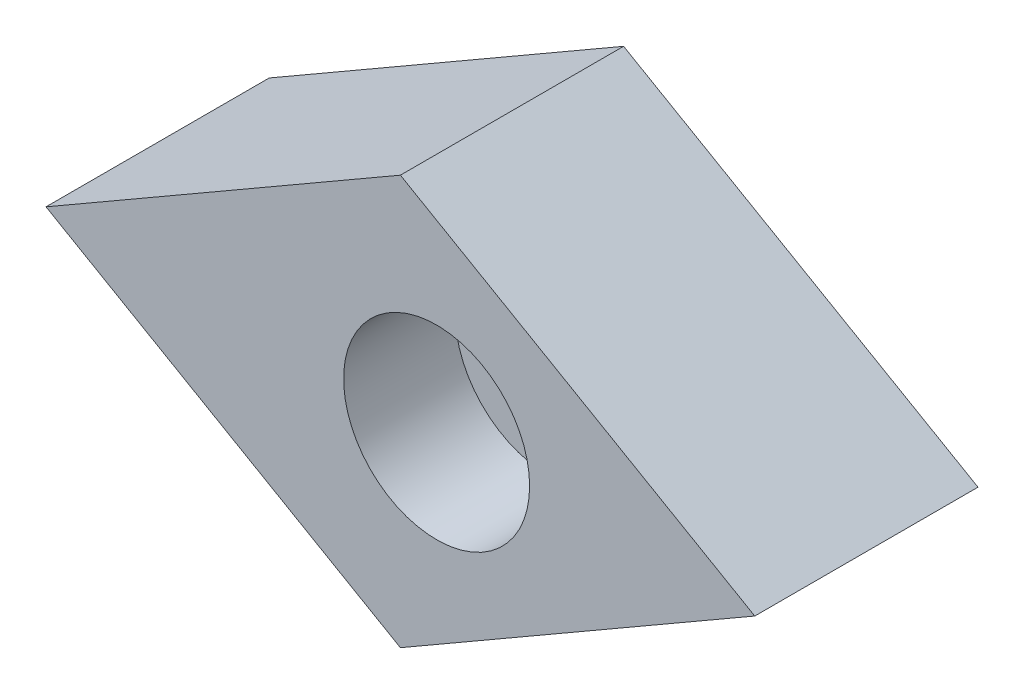
ISO-10303-21;
HEADER;
FILE_DESCRIPTION(('STEP AP214'),'2;1');
FILE_NAME('part.step','',(''),(''),'','','');
FILE_SCHEMA(('AUTOMOTIVE_DESIGN { 1 0 10303 214 1 1 1 1 }'));
ENDSEC;
DATA;
#1=APPLICATION_CONTEXT('core data for automotive mechanical design processes');
#2=APPLICATION_PROTOCOL_DEFINITION('international standard','automotive_design',2000,#1);
#3=PRODUCT_CONTEXT('',#1,'mechanical');
#4=PRODUCT('Part','Part','',(#3));
#5=PRODUCT_RELATED_PRODUCT_CATEGORY('part','',(#4));
#6=PRODUCT_DEFINITION_FORMATION('','',#4);
#7=PRODUCT_DEFINITION_CONTEXT('part definition',#1,'design');
#8=PRODUCT_DEFINITION('design','',#6,#7);
#9=PRODUCT_DEFINITION_SHAPE('','',#8);
#10=(LENGTH_UNIT() NAMED_UNIT(*) SI_UNIT(.MILLI.,.METRE.));
#11=(NAMED_UNIT(*) PLANE_ANGLE_UNIT() SI_UNIT($,.RADIAN.));
#12=(NAMED_UNIT(*) SI_UNIT($,.STERADIAN.) SOLID_ANGLE_UNIT());
#13=UNCERTAINTY_MEASURE_WITH_UNIT(LENGTH_MEASURE(1.E-05),#10,'distance_accuracy_value','');
#14=(GEOMETRIC_REPRESENTATION_CONTEXT(3) GLOBAL_UNCERTAINTY_ASSIGNED_CONTEXT((#13)) GLOBAL_UNIT_ASSIGNED_CONTEXT((#10,
#11,#12)) REPRESENTATION_CONTEXT('',''));
#15=CARTESIAN_POINT('',(0.,0.,0.));
#16=DIRECTION('',(0.,0.,1.));
#17=DIRECTION('',(1.,0.,0.));
#18=AXIS2_PLACEMENT_3D('',#15,#16,#17);
#19=CARTESIAN_POINT('',(9.5262794416289,0.,6.));
#20=DIRECTION('',(-0.499999999999988,-0.866025403784445,0.));
#21=DIRECTION('',(0.866025403784446,-0.499999999999988,0.));
#22=AXIS2_PLACEMENT_3D('',#19,#20,#21);
#23=PLANE('',#22);
#24=DIRECTION('',(-0.866025403784446,0.499999999999988,0.));
#25=VECTOR('',#24,1.);
#26=CARTESIAN_POINT('',(9.5262794416289,0.,0.));
#27=LINE('',#26,#25);
#28=CARTESIAN_POINT('',(9.5262794416289,0.,0.));
#29=VERTEX_POINT('',#28);
#30=CARTESIAN_POINT('',(0.,5.49999999999987,0.));
#31=VERTEX_POINT('',#30);
#32=EDGE_CURVE('E99',#29,#31,#27,.T.);
#33=ORIENTED_EDGE('',*,*,#32,.T.);
#34=DIRECTION('',(0.,0.,-1.));
#35=VECTOR('',#34,1.);
#36=CARTESIAN_POINT('',(0.,5.49999999999987,6.));
#37=LINE('',#36,#35);
#38=CARTESIAN_POINT('',(0.,5.49999999999987,6.));
#39=VERTEX_POINT('',#38);
#40=EDGE_CURVE('E11',#39,#31,#37,.T.);
#41=ORIENTED_EDGE('',*,*,#40,.F.);
#42=DIRECTION('',(-0.866025403784446,0.499999999999988,0.));
#43=VECTOR('',#42,1.);
#44=CARTESIAN_POINT('',(9.5262794416289,0.,6.));
#45=LINE('',#44,#43);
#46=CARTESIAN_POINT('',(9.5262794416289,0.,6.));
#47=VERTEX_POINT('',#46);
#48=EDGE_CURVE('E87',#47,#39,#45,.T.);
#49=ORIENTED_EDGE('',*,*,#48,.F.);
#50=DIRECTION('',(0.,0.,-1.));
#51=VECTOR('',#50,1.);
#52=CARTESIAN_POINT('',(9.5262794416289,0.,6.));
#53=LINE('',#52,#51);
#54=EDGE_CURVE('E95',#47,#29,#53,.T.);
#55=ORIENTED_EDGE('',*,*,#54,.T.);
#56=EDGE_LOOP('',(#33,#41,#49,#55));
#57=FACE_BOUND('',#56,.T.);
#58=ADVANCED_FACE('F36',(#57),#23,.F.);
#59=CARTESIAN_POINT('',(0.,5.49999999999987,6.));
#60=DIRECTION('',(0.499999999999994,-0.866025403784442,0.));
#61=DIRECTION('',(0.866025403784442,0.499999999999994,0.));
#62=AXIS2_PLACEMENT_3D('',#59,#60,#61);
#63=PLANE('',#62);
#64=DIRECTION('',(-0.866025403784442,-0.499999999999994,0.));
#65=VECTOR('',#64,1.);
#66=CARTESIAN_POINT('',(0.,5.49999999999987,0.));
#67=LINE('',#66,#65);
#68=CARTESIAN_POINT('',(-9.52627944162875,0.,0.));
#69=VERTEX_POINT('',#68);
#70=EDGE_CURVE('E91',#31,#69,#67,.T.);
#71=ORIENTED_EDGE('',*,*,#70,.T.);
#72=DIRECTION('',(0.,0.,-1.));
#73=VECTOR('',#72,1.);
#74=CARTESIAN_POINT('',(-9.52627944162875,0.,6.));
#75=LINE('',#74,#73);
#76=CARTESIAN_POINT('',(-9.52627944162875,0.,6.));
#77=VERTEX_POINT('',#76);
#78=EDGE_CURVE('E44',#77,#69,#75,.T.);
#79=ORIENTED_EDGE('',*,*,#78,.F.);
#80=DIRECTION('',(-0.866025403784442,-0.499999999999994,0.));
#81=VECTOR('',#80,1.);
#82=CARTESIAN_POINT('',(0.,5.49999999999987,6.));
#83=LINE('',#82,#81);
#84=EDGE_CURVE('E82',#39,#77,#83,.T.);
#85=ORIENTED_EDGE('',*,*,#84,.F.);
#86=ORIENTED_EDGE('',*,*,#40,.T.);
#87=EDGE_LOOP('',(#71,#79,#85,#86));
#88=FACE_BOUND('',#87,.T.);
#89=ADVANCED_FACE('F90',(#88),#63,.F.);
#90=CARTESIAN_POINT('',(-9.52627944162875,0.,6.));
#91=DIRECTION('',(0.500000000000001,0.866025403784438,0.));
#92=DIRECTION('',(-0.866025403784438,0.500000000000001,0.));
#93=AXIS2_PLACEMENT_3D('',#90,#91,#92);
#94=PLANE('',#93);
#95=DIRECTION('',(0.866025403784438,-0.500000000000001,0.));
#96=VECTOR('',#95,1.);
#97=CARTESIAN_POINT('',(-9.52627944162875,0.,0.));
#98=LINE('',#97,#96);
#99=CARTESIAN_POINT('',(0.,-5.49999999999997,0.));
#100=VERTEX_POINT('',#99);
#101=EDGE_CURVE('E69',#69,#100,#98,.T.);
#102=ORIENTED_EDGE('',*,*,#101,.T.);
#103=DIRECTION('',(0.,0.,-1.));
#104=VECTOR('',#103,1.);
#105=CARTESIAN_POINT('',(0.,-5.49999999999997,6.));
#106=LINE('',#105,#104);
#107=CARTESIAN_POINT('',(0.,-5.49999999999997,6.));
#108=VERTEX_POINT('',#107);
#109=EDGE_CURVE('E92',#108,#100,#106,.T.);
#110=ORIENTED_EDGE('',*,*,#109,.F.);
#111=DIRECTION('',(0.866025403784438,-0.500000000000001,0.));
#112=VECTOR('',#111,1.);
#113=CARTESIAN_POINT('',(-9.52627944162875,0.,6.));
#114=LINE('',#113,#112);
#115=EDGE_CURVE('E85',#77,#108,#114,.T.);
#116=ORIENTED_EDGE('',*,*,#115,.F.);
#117=ORIENTED_EDGE('',*,*,#78,.T.);
#118=EDGE_LOOP('',(#102,#110,#116,#117));
#119=FACE_BOUND('',#118,.T.);
#120=ADVANCED_FACE('F93',(#119),#94,.F.);
#121=CARTESIAN_POINT('',(0.,-5.49999999999997,6.));
#122=DIRECTION('',(-0.499999999999995,0.866025403784441,0.));
#123=DIRECTION('',(-0.866025403784442,-0.499999999999995,0.));
#124=AXIS2_PLACEMENT_3D('',#121,#122,#123);
#125=PLANE('',#124);
#126=DIRECTION('',(0.866025403784441,0.499999999999995,0.));
#127=VECTOR('',#126,1.);
#128=CARTESIAN_POINT('',(0.,-5.49999999999997,0.));
#129=LINE('',#128,#127);
#130=EDGE_CURVE('E75',#100,#29,#129,.T.);
#131=ORIENTED_EDGE('',*,*,#130,.T.);
#132=ORIENTED_EDGE('',*,*,#54,.F.);
#133=DIRECTION('',(0.866025403784441,0.499999999999995,0.));
#134=VECTOR('',#133,1.);
#135=CARTESIAN_POINT('',(0.,-5.49999999999997,6.));
#136=LINE('',#135,#134);
#137=EDGE_CURVE('E52',#108,#47,#136,.T.);
#138=ORIENTED_EDGE('',*,*,#137,.F.);
#139=ORIENTED_EDGE('',*,*,#109,.T.);
#140=EDGE_LOOP('',(#131,#132,#138,#139));
#141=FACE_BOUND('',#140,.T.);
#142=ADVANCED_FACE('F107',(#141),#125,.F.);
#143=CARTESIAN_POINT('',(0.,0.,6.));
#144=DIRECTION('',(0.,0.,1.));
#145=DIRECTION('',(1.,0.,0.));
#146=AXIS2_PLACEMENT_3D('',#143,#144,#145);
#147=PLANE('',#146);
#148=CARTESIAN_POINT('',(0.973720558371255,0.,6.));
#149=DIRECTION('',(0.,0.,1.));
#150=DIRECTION('',(1.,0.,0.));
#151=AXIS2_PLACEMENT_3D('',#148,#149,#150);
#152=CIRCLE('',#151,2.50000000000001);
#153=CARTESIAN_POINT('',(3.47372055837127,0.,6.));
#154=VERTEX_POINT('',#153);
#155=EDGE_CURVE('E121',#154,#154,#152,.T.);
#156=ORIENTED_EDGE('',*,*,#155,.F.);
#157=EDGE_LOOP('',(#156));
#158=FACE_BOUND('',#157,.T.);
#159=ORIENTED_EDGE('',*,*,#48,.T.);
#160=ORIENTED_EDGE('',*,*,#84,.T.);
#161=ORIENTED_EDGE('',*,*,#115,.T.);
#162=ORIENTED_EDGE('',*,*,#137,.T.);
#163=EDGE_LOOP('',(#159,#160,#161,#162));
#164=FACE_BOUND('',#163,.T.);
#165=ADVANCED_FACE('F83',(#158,#164),#147,.T.);
#166=CARTESIAN_POINT('',(0.,0.,0.));
#167=DIRECTION('',(0.,0.,1.));
#168=DIRECTION('',(1.,0.,0.));
#169=AXIS2_PLACEMENT_3D('',#166,#167,#168);
#170=PLANE('',#169);
#171=CARTESIAN_POINT('',(0.973720558371255,0.,0.));
#172=DIRECTION('',(0.,0.,1.));
#173=DIRECTION('',(1.,0.,0.));
#174=AXIS2_PLACEMENT_3D('',#171,#172,#173);
#175=CIRCLE('',#174,1.50000000000001);
#176=CARTESIAN_POINT('',(2.47372055837127,0.,0.));
#177=VERTEX_POINT('',#176);
#178=EDGE_CURVE('E102',#177,#177,#175,.T.);
#179=ORIENTED_EDGE('',*,*,#178,.T.);
#180=EDGE_LOOP('',(#179));
#181=FACE_BOUND('',#180,.T.);
#182=ORIENTED_EDGE('',*,*,#32,.F.);
#183=ORIENTED_EDGE('',*,*,#130,.F.);
#184=ORIENTED_EDGE('',*,*,#101,.F.);
#185=ORIENTED_EDGE('',*,*,#70,.F.);
#186=EDGE_LOOP('',(#182,#183,#184,#185));
#187=FACE_BOUND('',#186,.T.);
#188=ADVANCED_FACE('F110',(#181,#187),#170,.F.);
#189=CARTESIAN_POINT('',(0.973720558371255,0.,6.));
#190=DIRECTION('',(0.,0.,1.));
#191=DIRECTION('',(1.,0.,0.));
#192=AXIS2_PLACEMENT_3D('',#189,#190,#191);
#193=CYLINDRICAL_SURFACE('',#192,1.50000000000001);
#194=ORIENTED_EDGE('',*,*,#178,.F.);
#195=EDGE_LOOP('',(#194));
#196=FACE_BOUND('',#195,.T.);
#197=CARTESIAN_POINT('',(0.973720558371255,0.,3.));
#198=DIRECTION('',(0.,0.,1.));
#199=DIRECTION('',(1.,0.,0.));
#200=AXIS2_PLACEMENT_3D('',#197,#198,#199);
#201=CIRCLE('',#200,1.50000000000001);
#202=CARTESIAN_POINT('',(2.47372055837127,0.,3.));
#203=VERTEX_POINT('',#202);
#204=EDGE_CURVE('E115',#203,#203,#201,.T.);
#205=ORIENTED_EDGE('',*,*,#204,.T.);
#206=EDGE_LOOP('',(#205));
#207=FACE_BOUND('',#206,.T.);
#208=ADVANCED_FACE('F133',(#196,#207),#193,.F.);
#209=CARTESIAN_POINT('',(2.47372055837127,0.,3.));
#210=DIRECTION('',(0.,0.,-1.));
#211=DIRECTION('',(-1.,0.,0.));
#212=AXIS2_PLACEMENT_3D('',#209,#210,#211);
#213=PLANE('',#212);
#214=ORIENTED_EDGE('',*,*,#204,.F.);
#215=EDGE_LOOP('',(#214));
#216=FACE_BOUND('',#215,.T.);
#217=CARTESIAN_POINT('',(0.973720558371255,0.,3.));
#218=DIRECTION('',(0.,0.,1.));
#219=DIRECTION('',(1.,0.,0.));
#220=AXIS2_PLACEMENT_3D('',#217,#218,#219);
#221=CIRCLE('',#220,2.50000000000001);
#222=CARTESIAN_POINT('',(3.47372055837127,0.,3.));
#223=VERTEX_POINT('',#222);
#224=EDGE_CURVE('E118',#223,#223,#221,.T.);
#225=ORIENTED_EDGE('',*,*,#224,.T.);
#226=EDGE_LOOP('',(#225));
#227=FACE_BOUND('',#226,.T.);
#228=ADVANCED_FACE('F172',(#216,#227),#213,.F.);
#229=CARTESIAN_POINT('',(0.973720558371255,0.,6.));
#230=DIRECTION('',(0.,0.,1.));
#231=DIRECTION('',(1.,0.,0.));
#232=AXIS2_PLACEMENT_3D('',#229,#230,#231);
#233=CYLINDRICAL_SURFACE('',#232,2.50000000000001);
#234=ORIENTED_EDGE('',*,*,#224,.F.);
#235=EDGE_LOOP('',(#234));
#236=FACE_BOUND('',#235,.T.);
#237=ORIENTED_EDGE('',*,*,#155,.T.);
#238=EDGE_LOOP('',(#237));
#239=FACE_BOUND('',#238,.T.);
#240=ADVANCED_FACE('F125',(#236,#239),#233,.F.);
#241=CLOSED_SHELL('',(#58,#89,#120,#142,#165,#188,#208,#228,#240));
#242=MANIFOLD_SOLID_BREP('B2',#241);
#243=ADVANCED_BREP_SHAPE_REPRESENTATION('',(#18,#242),#14);
#244=SHAPE_DEFINITION_REPRESENTATION(#9,#243);
ENDSEC;
END-ISO-10303-21;
